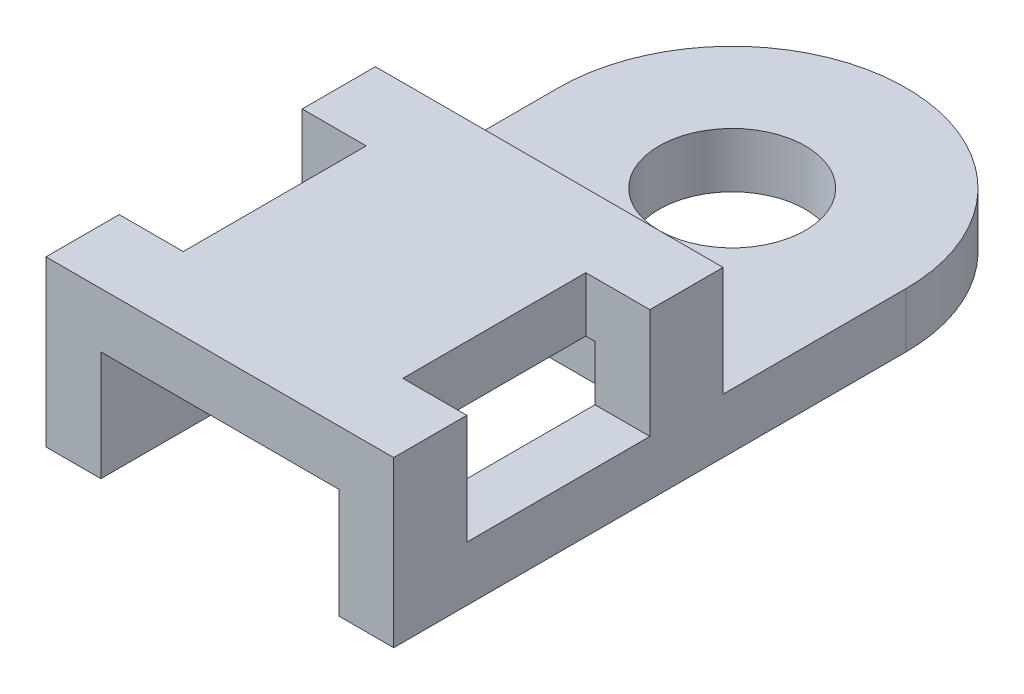
ISO-10303-21;
HEADER;
FILE_DESCRIPTION(('STEP AP214'),'2;1');
FILE_NAME('part.step','',(''),(''),'','','');
FILE_SCHEMA(('AUTOMOTIVE_DESIGN { 1 0 10303 214 1 1 1 1 }'));
ENDSEC;
DATA;
#1=APPLICATION_CONTEXT('core data for automotive mechanical design processes');
#2=APPLICATION_PROTOCOL_DEFINITION('international standard','automotive_design',2000,#1);
#3=PRODUCT_CONTEXT('',#1,'mechanical');
#4=PRODUCT('Part','Part','',(#3));
#5=PRODUCT_RELATED_PRODUCT_CATEGORY('part','',(#4));
#6=PRODUCT_DEFINITION_FORMATION('','',#4);
#7=PRODUCT_DEFINITION_CONTEXT('part definition',#1,'design');
#8=PRODUCT_DEFINITION('design','',#6,#7);
#9=PRODUCT_DEFINITION_SHAPE('','',#8);
#10=(LENGTH_UNIT() NAMED_UNIT(*) SI_UNIT(.MILLI.,.METRE.));
#11=(NAMED_UNIT(*) PLANE_ANGLE_UNIT() SI_UNIT($,.RADIAN.));
#12=(NAMED_UNIT(*) SI_UNIT($,.STERADIAN.) SOLID_ANGLE_UNIT());
#13=UNCERTAINTY_MEASURE_WITH_UNIT(LENGTH_MEASURE(1.E-05),#10,'distance_accuracy_value','');
#14=(GEOMETRIC_REPRESENTATION_CONTEXT(3) GLOBAL_UNCERTAINTY_ASSIGNED_CONTEXT((#13)) GLOBAL_UNIT_ASSIGNED_CONTEXT((#10,
#11,#12)) REPRESENTATION_CONTEXT('',''));
#15=CARTESIAN_POINT('',(0.,0.,0.));
#16=DIRECTION('',(0.,0.,1.));
#17=DIRECTION('',(1.,0.,0.));
#18=AXIS2_PLACEMENT_3D('',#15,#16,#17);
#19=CARTESIAN_POINT('',(0.,1.5,0.));
#20=DIRECTION('',(0.,1.,0.));
#21=DIRECTION('',(0.,0.,1.));
#22=AXIS2_PLACEMENT_3D('',#19,#20,#21);
#23=PLANE('',#22);
#24=DIRECTION('',(-1.,0.,0.));
#25=VECTOR('',#24,1.);
#26=CARTESIAN_POINT('',(4.75,1.5,5.));
#27=LINE('',#26,#25);
#28=CARTESIAN_POINT('',(4.75,1.5,5.));
#29=VERTEX_POINT('',#28);
#30=CARTESIAN_POINT('',(3.25,1.5,5.));
#31=VERTEX_POINT('',#30);
#32=EDGE_CURVE('E307',#29,#31,#27,.T.);
#33=ORIENTED_EDGE('',*,*,#32,.F.);
#34=DIRECTION('',(0.,0.,-1.));
#35=VECTOR('',#34,1.);
#36=CARTESIAN_POINT('',(4.75,1.5,14.));
#37=LINE('',#36,#35);
#38=CARTESIAN_POINT('',(4.75,1.5,0.));
#39=VERTEX_POINT('',#38);
#40=EDGE_CURVE('E330',#29,#39,#37,.T.);
#41=ORIENTED_EDGE('',*,*,#40,.T.);
#42=CARTESIAN_POINT('',(0.,1.5,0.));
#43=DIRECTION('',(0.,1.,0.));
#44=DIRECTION('',(0.,0.,1.));
#45=AXIS2_PLACEMENT_3D('',#42,#43,#44);
#46=CIRCLE('',#45,4.75);
#47=CARTESIAN_POINT('',(-4.75,1.5,0.));
#48=VERTEX_POINT('',#47);
#49=EDGE_CURVE('E323',#39,#48,#46,.T.);
#50=ORIENTED_EDGE('',*,*,#49,.T.);
#51=DIRECTION('',(0.,0.,1.));
#52=VECTOR('',#51,1.);
#53=CARTESIAN_POINT('',(-4.75,1.5,0.));
#54=LINE('',#53,#52);
#55=CARTESIAN_POINT('',(-4.75,1.5,5.));
#56=VERTEX_POINT('',#55);
#57=EDGE_CURVE('E326',#48,#56,#54,.T.);
#58=ORIENTED_EDGE('',*,*,#57,.T.);
#59=CARTESIAN_POINT('',(-3.25,1.5,5.));
#60=VERTEX_POINT('',#59);
#61=EDGE_CURVE('E284',#60,#56,#27,.T.);
#62=ORIENTED_EDGE('',*,*,#61,.F.);
#63=EDGE_CURVE('E310',#31,#60,#27,.T.);
#64=ORIENTED_EDGE('',*,*,#63,.F.);
#65=EDGE_LOOP('',(#33,#41,#50,#58,#62,#64));
#66=FACE_BOUND('',#65,.T.);
#67=CARTESIAN_POINT('',(0.,1.5,0.));
#68=DIRECTION('',(0.,1.,0.));
#69=DIRECTION('',(0.,0.,1.));
#70=AXIS2_PLACEMENT_3D('',#67,#68,#69);
#71=CIRCLE('',#70,2.);
#72=CARTESIAN_POINT('',(0.,1.5,2.));
#73=VERTEX_POINT('',#72);
#74=EDGE_CURVE('E317',#73,#73,#71,.T.);
#75=ORIENTED_EDGE('',*,*,#74,.F.);
#76=EDGE_LOOP('',(#75));
#77=FACE_BOUND('',#76,.T.);
#78=ADVANCED_FACE('F35',(#66,#77),#23,.T.);
#79=CARTESIAN_POINT('',(0.,0.,0.));
#80=DIRECTION('',(0.,1.,0.));
#81=DIRECTION('',(0.,0.,1.));
#82=AXIS2_PLACEMENT_3D('',#79,#80,#81);
#83=PLANE('',#82);
#84=DIRECTION('',(1.,0.,0.));
#85=VECTOR('',#84,1.);
#86=CARTESIAN_POINT('',(-4.75,0.,14.));
#87=LINE('',#86,#85);
#88=CARTESIAN_POINT('',(3.25,0.,14.));
#89=VERTEX_POINT('',#88);
#90=CARTESIAN_POINT('',(4.75,0.,14.));
#91=VERTEX_POINT('',#90);
#92=EDGE_CURVE('E337',#89,#91,#87,.T.);
#93=ORIENTED_EDGE('',*,*,#92,.F.);
#94=DIRECTION('',(0.,0.,1.));
#95=VECTOR('',#94,1.);
#96=CARTESIAN_POINT('',(3.25,0.,14.));
#97=LINE('',#96,#95);
#98=CARTESIAN_POINT('',(3.25,0.,5.));
#99=VERTEX_POINT('',#98);
#100=EDGE_CURVE('E264',#99,#89,#97,.T.);
#101=ORIENTED_EDGE('',*,*,#100,.F.);
#102=DIRECTION('',(1.,0.,0.));
#103=VECTOR('',#102,1.);
#104=CARTESIAN_POINT('',(3.25,0.,5.));
#105=LINE('',#104,#103);
#106=CARTESIAN_POINT('',(-3.25,0.,5.));
#107=VERTEX_POINT('',#106);
#108=EDGE_CURVE('E277',#107,#99,#105,.T.);
#109=ORIENTED_EDGE('',*,*,#108,.F.);
#110=DIRECTION('',(0.,0.,-1.));
#111=VECTOR('',#110,1.);
#112=CARTESIAN_POINT('',(-3.25,0.,5.));
#113=LINE('',#112,#111);
#114=CARTESIAN_POINT('',(-3.25,0.,14.));
#115=VERTEX_POINT('',#114);
#116=EDGE_CURVE('E259',#115,#107,#113,.T.);
#117=ORIENTED_EDGE('',*,*,#116,.F.);
#118=CARTESIAN_POINT('',(-4.75,0.,14.));
#119=VERTEX_POINT('',#118);
#120=EDGE_CURVE('E338',#119,#115,#87,.T.);
#121=ORIENTED_EDGE('',*,*,#120,.F.);
#122=DIRECTION('',(0.,0.,1.));
#123=VECTOR('',#122,1.);
#124=CARTESIAN_POINT('',(-4.75,0.,0.));
#125=LINE('',#124,#123);
#126=CARTESIAN_POINT('',(-4.75,0.,0.));
#127=VERTEX_POINT('',#126);
#128=EDGE_CURVE('E335',#127,#119,#125,.T.);
#129=ORIENTED_EDGE('',*,*,#128,.F.);
#130=CARTESIAN_POINT('',(0.,0.,0.));
#131=DIRECTION('',(0.,1.,0.));
#132=DIRECTION('',(0.,0.,1.));
#133=AXIS2_PLACEMENT_3D('',#130,#131,#132);
#134=CIRCLE('',#133,4.75);
#135=CARTESIAN_POINT('',(4.75,0.,0.));
#136=VERTEX_POINT('',#135);
#137=EDGE_CURVE('E320',#136,#127,#134,.T.);
#138=ORIENTED_EDGE('',*,*,#137,.F.);
#139=DIRECTION('',(0.,0.,-1.));
#140=VECTOR('',#139,1.);
#141=CARTESIAN_POINT('',(4.75,0.,14.));
#142=LINE('',#141,#140);
#143=EDGE_CURVE('E327',#91,#136,#142,.T.);
#144=ORIENTED_EDGE('',*,*,#143,.F.);
#145=EDGE_LOOP('',(#93,#101,#109,#117,#121,#129,#138,#144));
#146=FACE_BOUND('',#145,.T.);
#147=CARTESIAN_POINT('',(0.,0.,0.));
#148=DIRECTION('',(0.,1.,0.));
#149=DIRECTION('',(0.,0.,1.));
#150=AXIS2_PLACEMENT_3D('',#147,#148,#149);
#151=CIRCLE('',#150,2.);
#152=CARTESIAN_POINT('',(0.,0.,2.));
#153=VERTEX_POINT('',#152);
#154=EDGE_CURVE('E316',#153,#153,#151,.T.);
#155=ORIENTED_EDGE('',*,*,#154,.T.);
#156=EDGE_LOOP('',(#155));
#157=FACE_BOUND('',#156,.T.);
#158=ADVANCED_FACE('F430',(#146,#157),#83,.F.);
#159=CARTESIAN_POINT('',(0.,1.5,0.));
#160=DIRECTION('',(0.,-1.,0.));
#161=DIRECTION('',(0.,0.,-1.));
#162=AXIS2_PLACEMENT_3D('',#159,#160,#161);
#163=CYLINDRICAL_SURFACE('',#162,4.75);
#164=ORIENTED_EDGE('',*,*,#137,.T.);
#165=DIRECTION('',(0.,-1.,0.));
#166=VECTOR('',#165,1.);
#167=CARTESIAN_POINT('',(-4.75,1.5,0.));
#168=LINE('',#167,#166);
#169=EDGE_CURVE('E350',#48,#127,#168,.T.);
#170=ORIENTED_EDGE('',*,*,#169,.F.);
#171=ORIENTED_EDGE('',*,*,#49,.F.);
#172=DIRECTION('',(0.,-1.,0.));
#173=VECTOR('',#172,1.);
#174=CARTESIAN_POINT('',(4.75,1.5,0.));
#175=LINE('',#174,#173);
#176=EDGE_CURVE('E332',#39,#136,#175,.T.);
#177=ORIENTED_EDGE('',*,*,#176,.T.);
#178=EDGE_LOOP('',(#164,#170,#171,#177));
#179=FACE_BOUND('',#178,.T.);
#180=ADVANCED_FACE('F37',(#179),#163,.T.);
#181=CARTESIAN_POINT('',(-4.75,1.5,0.));
#182=DIRECTION('',(1.,0.,0.));
#183=DIRECTION('',(0.,0.,-1.));
#184=AXIS2_PLACEMENT_3D('',#181,#182,#183);
#185=PLANE('',#184);
#186=DIRECTION('',(0.,0.,1.));
#187=VECTOR('',#186,1.);
#188=CARTESIAN_POINT('',(-4.75,1.5,12.));
#189=LINE('',#188,#187);
#190=CARTESIAN_POINT('',(-4.75,1.5,7.));
#191=VERTEX_POINT('',#190);
#192=CARTESIAN_POINT('',(-4.75,1.5,12.));
#193=VERTEX_POINT('',#192);
#194=EDGE_CURVE('E229',#191,#193,#189,.T.);
#195=ORIENTED_EDGE('',*,*,#194,.F.);
#196=DIRECTION('',(0.,1.,0.));
#197=VECTOR('',#196,1.);
#198=CARTESIAN_POINT('',(-4.75,1.5,7.));
#199=LINE('',#198,#197);
#200=CARTESIAN_POINT('',(-4.75,4.5,7.));
#201=VERTEX_POINT('',#200);
#202=EDGE_CURVE('E245',#191,#201,#199,.T.);
#203=ORIENTED_EDGE('',*,*,#202,.T.);
#204=DIRECTION('',(0.,0.,1.));
#205=VECTOR('',#204,1.);
#206=CARTESIAN_POINT('',(-4.75,4.5,5.));
#207=LINE('',#206,#205);
#208=CARTESIAN_POINT('',(-4.75,4.5,5.));
#209=VERTEX_POINT('',#208);
#210=EDGE_CURVE('E294',#209,#201,#207,.T.);
#211=ORIENTED_EDGE('',*,*,#210,.F.);
#212=DIRECTION('',(0.,-1.,0.));
#213=VECTOR('',#212,1.);
#214=CARTESIAN_POINT('',(-4.75,4.5,5.));
#215=LINE('',#214,#213);
#216=EDGE_CURVE('E306',#209,#56,#215,.T.);
#217=ORIENTED_EDGE('',*,*,#216,.T.);
#218=ORIENTED_EDGE('',*,*,#57,.F.);
#219=ORIENTED_EDGE('',*,*,#169,.T.);
#220=ORIENTED_EDGE('',*,*,#128,.T.);
#221=DIRECTION('',(0.,-1.,0.));
#222=VECTOR('',#221,1.);
#223=CARTESIAN_POINT('',(-4.75,1.5,14.));
#224=LINE('',#223,#222);
#225=CARTESIAN_POINT('',(-4.75,4.5,14.));
#226=VERTEX_POINT('',#225);
#227=EDGE_CURVE('E347',#226,#119,#224,.T.);
#228=ORIENTED_EDGE('',*,*,#227,.F.);
#229=CARTESIAN_POINT('',(-4.75,4.5,12.));
#230=VERTEX_POINT('',#229);
#231=EDGE_CURVE('E298',#230,#226,#207,.T.);
#232=ORIENTED_EDGE('',*,*,#231,.F.);
#233=DIRECTION('',(0.,1.,0.));
#234=VECTOR('',#233,1.);
#235=CARTESIAN_POINT('',(-4.75,1.5,12.));
#236=LINE('',#235,#234);
#237=EDGE_CURVE('E238',#193,#230,#236,.T.);
#238=ORIENTED_EDGE('',*,*,#237,.F.);
#239=EDGE_LOOP('',(#195,#203,#211,#217,#218,#219,#220,#228,#232,#238));
#240=FACE_BOUND('',#239,.T.);
#241=ADVANCED_FACE('F398',(#240),#185,.F.);
#242=CARTESIAN_POINT('',(-4.75,1.5,14.));
#243=DIRECTION('',(0.,0.,-1.));
#244=DIRECTION('',(-1.,0.,0.));
#245=AXIS2_PLACEMENT_3D('',#242,#243,#244);
#246=PLANE('',#245);
#247=DIRECTION('',(-1.,0.,0.));
#248=VECTOR('',#247,1.);
#249=CARTESIAN_POINT('',(-3.25,3.,14.));
#250=LINE('',#249,#248);
#251=CARTESIAN_POINT('',(3.25,3.,14.));
#252=VERTEX_POINT('',#251);
#253=CARTESIAN_POINT('',(-3.25,3.,14.));
#254=VERTEX_POINT('',#253);
#255=EDGE_CURVE('E260',#252,#254,#250,.T.);
#256=ORIENTED_EDGE('',*,*,#255,.F.);
#257=DIRECTION('',(0.,-1.,0.));
#258=VECTOR('',#257,1.);
#259=CARTESIAN_POINT('',(3.25,3.,14.));
#260=LINE('',#259,#258);
#261=EDGE_CURVE('E281',#252,#89,#260,.T.);
#262=ORIENTED_EDGE('',*,*,#261,.T.);
#263=ORIENTED_EDGE('',*,*,#92,.T.);
#264=DIRECTION('',(0.,-1.,0.));
#265=VECTOR('',#264,1.);
#266=CARTESIAN_POINT('',(4.75,1.5,14.));
#267=LINE('',#266,#265);
#268=CARTESIAN_POINT('',(4.75,4.5,14.));
#269=VERTEX_POINT('',#268);
#270=EDGE_CURVE('E344',#269,#91,#267,.T.);
#271=ORIENTED_EDGE('',*,*,#270,.F.);
#272=DIRECTION('',(1.,0.,0.));
#273=VECTOR('',#272,1.);
#274=CARTESIAN_POINT('',(-4.75,4.5,14.));
#275=LINE('',#274,#273);
#276=EDGE_CURVE('E297',#226,#269,#275,.T.);
#277=ORIENTED_EDGE('',*,*,#276,.F.);
#278=ORIENTED_EDGE('',*,*,#227,.T.);
#279=ORIENTED_EDGE('',*,*,#120,.T.);
#280=DIRECTION('',(0.,-1.,0.));
#281=VECTOR('',#280,1.);
#282=CARTESIAN_POINT('',(-3.25,3.,14.));
#283=LINE('',#282,#281);
#284=EDGE_CURVE('E274',#254,#115,#283,.T.);
#285=ORIENTED_EDGE('',*,*,#284,.F.);
#286=EDGE_LOOP('',(#256,#262,#263,#271,#277,#278,#279,#285));
#287=FACE_BOUND('',#286,.T.);
#288=ADVANCED_FACE('F383',(#287),#246,.F.);
#289=CARTESIAN_POINT('',(4.75,1.5,14.));
#290=DIRECTION('',(-1.,0.,0.));
#291=DIRECTION('',(0.,0.,1.));
#292=AXIS2_PLACEMENT_3D('',#289,#290,#291);
#293=PLANE('',#292);
#294=DIRECTION('',(0.,0.,-1.));
#295=VECTOR('',#294,1.);
#296=CARTESIAN_POINT('',(4.75,1.5,12.));
#297=LINE('',#296,#295);
#298=CARTESIAN_POINT('',(4.75,1.5,12.));
#299=VERTEX_POINT('',#298);
#300=CARTESIAN_POINT('',(4.75,1.5,7.));
#301=VERTEX_POINT('',#300);
#302=EDGE_CURVE('E193',#299,#301,#297,.T.);
#303=ORIENTED_EDGE('',*,*,#302,.F.);
#304=DIRECTION('',(0.,1.,0.));
#305=VECTOR('',#304,1.);
#306=CARTESIAN_POINT('',(4.75,1.5,12.));
#307=LINE('',#306,#305);
#308=CARTESIAN_POINT('',(4.75,4.5,12.));
#309=VERTEX_POINT('',#308);
#310=EDGE_CURVE('E200',#299,#309,#307,.T.);
#311=ORIENTED_EDGE('',*,*,#310,.T.);
#312=DIRECTION('',(0.,0.,-1.));
#313=VECTOR('',#312,1.);
#314=CARTESIAN_POINT('',(4.75,4.5,14.));
#315=LINE('',#314,#313);
#316=EDGE_CURVE('E302',#269,#309,#315,.T.);
#317=ORIENTED_EDGE('',*,*,#316,.F.);
#318=ORIENTED_EDGE('',*,*,#270,.T.);
#319=ORIENTED_EDGE('',*,*,#143,.T.);
#320=ORIENTED_EDGE('',*,*,#176,.F.);
#321=ORIENTED_EDGE('',*,*,#40,.F.);
#322=DIRECTION('',(0.,-1.,0.));
#323=VECTOR('',#322,1.);
#324=CARTESIAN_POINT('',(4.75,4.5,5.));
#325=LINE('',#324,#323);
#326=CARTESIAN_POINT('',(4.75,4.5,5.));
#327=VERTEX_POINT('',#326);
#328=EDGE_CURVE('E313',#327,#29,#325,.T.);
#329=ORIENTED_EDGE('',*,*,#328,.F.);
#330=CARTESIAN_POINT('',(4.75,4.5,7.));
#331=VERTEX_POINT('',#330);
#332=EDGE_CURVE('E301',#331,#327,#315,.T.);
#333=ORIENTED_EDGE('',*,*,#332,.F.);
#334=DIRECTION('',(0.,1.,0.));
#335=VECTOR('',#334,1.);
#336=CARTESIAN_POINT('',(4.75,1.5,7.));
#337=LINE('',#336,#335);
#338=EDGE_CURVE('E50',#301,#331,#337,.T.);
#339=ORIENTED_EDGE('',*,*,#338,.F.);
#340=EDGE_LOOP('',(#303,#311,#317,#318,#319,#320,#321,#329,#333,#339));
#341=FACE_BOUND('',#340,.T.);
#342=ADVANCED_FACE('F209',(#341),#293,.F.);
#343=CARTESIAN_POINT('',(0.,1.5,0.));
#344=DIRECTION('',(0.,-1.,0.));
#345=DIRECTION('',(0.,0.,-1.));
#346=AXIS2_PLACEMENT_3D('',#343,#344,#345);
#347=CYLINDRICAL_SURFACE('',#346,2.);
#348=ORIENTED_EDGE('',*,*,#74,.T.);
#349=EDGE_LOOP('',(#348));
#350=FACE_BOUND('',#349,.T.);
#351=ORIENTED_EDGE('',*,*,#154,.F.);
#352=EDGE_LOOP('',(#351));
#353=FACE_BOUND('',#352,.T.);
#354=ADVANCED_FACE('F440',(#350,#353),#347,.F.);
#355=CARTESIAN_POINT('',(4.75,4.5,5.));
#356=DIRECTION('',(0.,0.,1.));
#357=DIRECTION('',(1.,0.,0.));
#358=AXIS2_PLACEMENT_3D('',#355,#356,#357);
#359=PLANE('',#358);
#360=ORIENTED_EDGE('',*,*,#32,.T.);
#361=DIRECTION('',(0.,-1.,0.));
#362=VECTOR('',#361,1.);
#363=CARTESIAN_POINT('',(3.25,3.,5.));
#364=LINE('',#363,#362);
#365=CARTESIAN_POINT('',(3.25,3.,5.));
#366=VERTEX_POINT('',#365);
#367=EDGE_CURVE('E285',#366,#31,#364,.T.);
#368=ORIENTED_EDGE('',*,*,#367,.F.);
#369=DIRECTION('',(1.,0.,0.));
#370=VECTOR('',#369,1.);
#371=CARTESIAN_POINT('',(3.25,3.,5.));
#372=LINE('',#371,#370);
#373=CARTESIAN_POINT('',(-3.25,3.,5.));
#374=VERTEX_POINT('',#373);
#375=EDGE_CURVE('E268',#374,#366,#372,.T.);
#376=ORIENTED_EDGE('',*,*,#375,.F.);
#377=DIRECTION('',(0.,-1.,0.));
#378=VECTOR('',#377,1.);
#379=CARTESIAN_POINT('',(-3.25,3.,5.));
#380=LINE('',#379,#378);
#381=EDGE_CURVE('E289',#374,#60,#380,.T.);
#382=ORIENTED_EDGE('',*,*,#381,.T.);
#383=ORIENTED_EDGE('',*,*,#61,.T.);
#384=ORIENTED_EDGE('',*,*,#216,.F.);
#385=DIRECTION('',(-1.,0.,0.));
#386=VECTOR('',#385,1.);
#387=CARTESIAN_POINT('',(4.75,4.5,5.));
#388=LINE('',#387,#386);
#389=EDGE_CURVE('E304',#327,#209,#388,.T.);
#390=ORIENTED_EDGE('',*,*,#389,.F.);
#391=ORIENTED_EDGE('',*,*,#328,.T.);
#392=EDGE_LOOP('',(#360,#368,#376,#382,#383,#384,#390,#391));
#393=FACE_BOUND('',#392,.T.);
#394=ADVANCED_FACE('F416',(#393),#359,.F.);
#395=CARTESIAN_POINT('',(0.,4.5,0.));
#396=DIRECTION('',(0.,1.,0.));
#397=DIRECTION('',(0.,0.,1.));
#398=AXIS2_PLACEMENT_3D('',#395,#396,#397);
#399=PLANE('',#398);
#400=DIRECTION('',(1.,0.,0.));
#401=VECTOR('',#400,1.);
#402=CARTESIAN_POINT('',(3.,4.5,12.));
#403=LINE('',#402,#401);
#404=CARTESIAN_POINT('',(3.,4.5,12.));
#405=VERTEX_POINT('',#404);
#406=EDGE_CURVE('E203',#405,#309,#403,.T.);
#407=ORIENTED_EDGE('',*,*,#406,.F.);
#408=DIRECTION('',(0.,0.,1.));
#409=VECTOR('',#408,1.);
#410=CARTESIAN_POINT('',(3.,4.5,7.));
#411=LINE('',#410,#409);
#412=CARTESIAN_POINT('',(3.,4.5,7.));
#413=VERTEX_POINT('',#412);
#414=EDGE_CURVE('E197',#413,#405,#411,.T.);
#415=ORIENTED_EDGE('',*,*,#414,.F.);
#416=DIRECTION('',(-1.,0.,0.));
#417=VECTOR('',#416,1.);
#418=CARTESIAN_POINT('',(4.75,4.5,7.));
#419=LINE('',#418,#417);
#420=EDGE_CURVE('E215',#331,#413,#419,.T.);
#421=ORIENTED_EDGE('',*,*,#420,.F.);
#422=ORIENTED_EDGE('',*,*,#332,.T.);
#423=ORIENTED_EDGE('',*,*,#389,.T.);
#424=ORIENTED_EDGE('',*,*,#210,.T.);
#425=DIRECTION('',(-1.,0.,0.));
#426=VECTOR('',#425,1.);
#427=CARTESIAN_POINT('',(-4.75,4.5,7.));
#428=LINE('',#427,#426);
#429=CARTESIAN_POINT('',(-3.,4.5,7.));
#430=VERTEX_POINT('',#429);
#431=EDGE_CURVE('E233',#430,#201,#428,.T.);
#432=ORIENTED_EDGE('',*,*,#431,.F.);
#433=DIRECTION('',(0.,0.,-1.));
#434=VECTOR('',#433,1.);
#435=CARTESIAN_POINT('',(-3.,4.5,7.));
#436=LINE('',#435,#434);
#437=CARTESIAN_POINT('',(-3.,4.5,12.));
#438=VERTEX_POINT('',#437);
#439=EDGE_CURVE('E241',#438,#430,#436,.T.);
#440=ORIENTED_EDGE('',*,*,#439,.F.);
#441=DIRECTION('',(1.,0.,0.));
#442=VECTOR('',#441,1.);
#443=CARTESIAN_POINT('',(-3.,4.5,12.));
#444=LINE('',#443,#442);
#445=EDGE_CURVE('E228',#230,#438,#444,.T.);
#446=ORIENTED_EDGE('',*,*,#445,.F.);
#447=ORIENTED_EDGE('',*,*,#231,.T.);
#448=ORIENTED_EDGE('',*,*,#276,.T.);
#449=ORIENTED_EDGE('',*,*,#316,.T.);
#450=EDGE_LOOP('',(#407,#415,#421,#422,#423,#424,#432,#440,#446,#447,#448,#449));
#451=FACE_BOUND('',#450,.T.);
#452=ADVANCED_FACE('F403',(#451),#399,.T.);
#453=CARTESIAN_POINT('',(3.25,3.,14.));
#454=DIRECTION('',(1.,0.,0.));
#455=DIRECTION('',(0.,0.,-1.));
#456=AXIS2_PLACEMENT_3D('',#453,#454,#455);
#457=PLANE('',#456);
#458=DIRECTION('',(0.,0.,1.));
#459=VECTOR('',#458,1.);
#460=CARTESIAN_POINT('',(3.25,3.,14.));
#461=LINE('',#460,#459);
#462=CARTESIAN_POINT('',(3.25,3.,12.));
#463=VERTEX_POINT('',#462);
#464=EDGE_CURVE('E270',#463,#252,#461,.T.);
#465=ORIENTED_EDGE('',*,*,#464,.F.);
#466=DIRECTION('',(0.,-1.,0.));
#467=VECTOR('',#466,1.);
#468=CARTESIAN_POINT('',(3.25,3.,12.));
#469=LINE('',#468,#467);
#470=CARTESIAN_POINT('',(3.25,1.5,12.));
#471=VERTEX_POINT('',#470);
#472=EDGE_CURVE('E226',#463,#471,#469,.T.);
#473=ORIENTED_EDGE('',*,*,#472,.T.);
#474=DIRECTION('',(0.,0.,1.));
#475=VECTOR('',#474,1.);
#476=CARTESIAN_POINT('',(3.25,1.5,14.));
#477=LINE('',#476,#475);
#478=CARTESIAN_POINT('',(3.25,1.5,7.));
#479=VERTEX_POINT('',#478);
#480=EDGE_CURVE('E11',#479,#471,#477,.T.);
#481=ORIENTED_EDGE('',*,*,#480,.F.);
#482=DIRECTION('',(0.,1.,0.));
#483=VECTOR('',#482,1.);
#484=CARTESIAN_POINT('',(3.25,3.,7.));
#485=LINE('',#484,#483);
#486=CARTESIAN_POINT('',(3.25,3.,7.));
#487=VERTEX_POINT('',#486);
#488=EDGE_CURVE('E221',#479,#487,#485,.T.);
#489=ORIENTED_EDGE('',*,*,#488,.T.);
#490=EDGE_CURVE('E271',#366,#487,#461,.T.);
#491=ORIENTED_EDGE('',*,*,#490,.F.);
#492=ORIENTED_EDGE('',*,*,#367,.T.);
#493=EDGE_CURVE('E288',#31,#99,#364,.T.);
#494=ORIENTED_EDGE('',*,*,#493,.T.);
#495=ORIENTED_EDGE('',*,*,#100,.T.);
#496=ORIENTED_EDGE('',*,*,#261,.F.);
#497=EDGE_LOOP('',(#465,#473,#481,#489,#491,#492,#494,#495,#496));
#498=FACE_BOUND('',#497,.T.);
#499=ADVANCED_FACE('F377',(#498),#457,.F.);
#500=CARTESIAN_POINT('',(3.25,3.,5.));
#501=DIRECTION('',(0.,0.,-1.));
#502=DIRECTION('',(-1.,0.,0.));
#503=AXIS2_PLACEMENT_3D('',#500,#501,#502);
#504=PLANE('',#503);
#505=ORIENTED_EDGE('',*,*,#63,.T.);
#506=EDGE_CURVE('E292',#60,#107,#380,.T.);
#507=ORIENTED_EDGE('',*,*,#506,.T.);
#508=ORIENTED_EDGE('',*,*,#108,.T.);
#509=ORIENTED_EDGE('',*,*,#493,.F.);
#510=EDGE_LOOP('',(#505,#507,#508,#509));
#511=FACE_BOUND('',#510,.T.);
#512=ADVANCED_FACE('F483',(#511),#504,.F.);
#513=CARTESIAN_POINT('',(-3.25,3.,5.));
#514=DIRECTION('',(-1.,0.,0.));
#515=DIRECTION('',(0.,0.,1.));
#516=AXIS2_PLACEMENT_3D('',#513,#514,#515);
#517=PLANE('',#516);
#518=DIRECTION('',(0.,0.,-1.));
#519=VECTOR('',#518,1.);
#520=CARTESIAN_POINT('',(-3.25,3.,5.));
#521=LINE('',#520,#519);
#522=CARTESIAN_POINT('',(-3.25,3.,7.));
#523=VERTEX_POINT('',#522);
#524=EDGE_CURVE('E263',#523,#374,#521,.T.);
#525=ORIENTED_EDGE('',*,*,#524,.F.);
#526=DIRECTION('',(0.,-1.,0.));
#527=VECTOR('',#526,1.);
#528=CARTESIAN_POINT('',(-3.25,3.,7.));
#529=LINE('',#528,#527);
#530=CARTESIAN_POINT('',(-3.25,1.5,7.));
#531=VERTEX_POINT('',#530);
#532=EDGE_CURVE('E256',#523,#531,#529,.T.);
#533=ORIENTED_EDGE('',*,*,#532,.T.);
#534=DIRECTION('',(0.,0.,1.));
#535=VECTOR('',#534,1.);
#536=CARTESIAN_POINT('',(-3.25,1.5,5.));
#537=LINE('',#536,#535);
#538=CARTESIAN_POINT('',(-3.25,1.5,12.));
#539=VERTEX_POINT('',#538);
#540=EDGE_CURVE('E362',#531,#539,#537,.T.);
#541=ORIENTED_EDGE('',*,*,#540,.T.);
#542=DIRECTION('',(0.,1.,0.));
#543=VECTOR('',#542,1.);
#544=CARTESIAN_POINT('',(-3.25,3.,12.));
#545=LINE('',#544,#543);
#546=CARTESIAN_POINT('',(-3.25,3.,12.));
#547=VERTEX_POINT('',#546);
#548=EDGE_CURVE('E248',#539,#547,#545,.T.);
#549=ORIENTED_EDGE('',*,*,#548,.T.);
#550=EDGE_CURVE('E265',#254,#547,#521,.T.);
#551=ORIENTED_EDGE('',*,*,#550,.F.);
#552=ORIENTED_EDGE('',*,*,#284,.T.);
#553=ORIENTED_EDGE('',*,*,#116,.T.);
#554=ORIENTED_EDGE('',*,*,#506,.F.);
#555=ORIENTED_EDGE('',*,*,#381,.F.);
#556=EDGE_LOOP('',(#525,#533,#541,#549,#551,#552,#553,#554,#555));
#557=FACE_BOUND('',#556,.T.);
#558=ADVANCED_FACE('F386',(#557),#517,.F.);
#559=CARTESIAN_POINT('',(0.,3.,0.));
#560=DIRECTION('',(0.,1.,0.));
#561=DIRECTION('',(0.,0.,1.));
#562=AXIS2_PLACEMENT_3D('',#559,#560,#561);
#563=PLANE('',#562);
#564=DIRECTION('',(0.,0.,1.));
#565=VECTOR('',#564,1.);
#566=CARTESIAN_POINT('',(3.,3.,0.));
#567=LINE('',#566,#565);
#568=CARTESIAN_POINT('',(3.,3.,7.));
#569=VERTEX_POINT('',#568);
#570=CARTESIAN_POINT('',(3.,3.,12.));
#571=VERTEX_POINT('',#570);
#572=EDGE_CURVE('E368',#569,#571,#567,.T.);
#573=ORIENTED_EDGE('',*,*,#572,.T.);
#574=DIRECTION('',(1.,0.,0.));
#575=VECTOR('',#574,1.);
#576=CARTESIAN_POINT('',(0.,3.,12.));
#577=LINE('',#576,#575);
#578=EDGE_CURVE('E43',#571,#463,#577,.T.);
#579=ORIENTED_EDGE('',*,*,#578,.T.);
#580=ORIENTED_EDGE('',*,*,#464,.T.);
#581=ORIENTED_EDGE('',*,*,#255,.T.);
#582=ORIENTED_EDGE('',*,*,#550,.T.);
#583=DIRECTION('',(1.,0.,0.));
#584=VECTOR('',#583,1.);
#585=CARTESIAN_POINT('',(0.,3.,12.));
#586=LINE('',#585,#584);
#587=CARTESIAN_POINT('',(-3.,3.,12.));
#588=VERTEX_POINT('',#587);
#589=EDGE_CURVE('E353',#547,#588,#586,.T.);
#590=ORIENTED_EDGE('',*,*,#589,.T.);
#591=DIRECTION('',(0.,0.,-1.));
#592=VECTOR('',#591,1.);
#593=CARTESIAN_POINT('',(-3.,3.,0.));
#594=LINE('',#593,#592);
#595=CARTESIAN_POINT('',(-3.,3.,7.));
#596=VERTEX_POINT('',#595);
#597=EDGE_CURVE('E356',#588,#596,#594,.T.);
#598=ORIENTED_EDGE('',*,*,#597,.T.);
#599=DIRECTION('',(-1.,0.,0.));
#600=VECTOR('',#599,1.);
#601=CARTESIAN_POINT('',(0.,3.,7.));
#602=LINE('',#601,#600);
#603=EDGE_CURVE('E359',#596,#523,#602,.T.);
#604=ORIENTED_EDGE('',*,*,#603,.T.);
#605=ORIENTED_EDGE('',*,*,#524,.T.);
#606=ORIENTED_EDGE('',*,*,#375,.T.);
#607=ORIENTED_EDGE('',*,*,#490,.T.);
#608=DIRECTION('',(-1.,0.,0.));
#609=VECTOR('',#608,1.);
#610=CARTESIAN_POINT('',(0.,3.,7.));
#611=LINE('',#610,#609);
#612=EDGE_CURVE('E365',#487,#569,#611,.T.);
#613=ORIENTED_EDGE('',*,*,#612,.T.);
#614=EDGE_LOOP('',(#573,#579,#580,#581,#582,#590,#598,#604,#605,#606,#607,#613));
#615=FACE_BOUND('',#614,.T.);
#616=ADVANCED_FACE('F373',(#615),#563,.F.);
#617=CARTESIAN_POINT('',(0.,1.5,0.));
#618=DIRECTION('',(0.,-1.,0.));
#619=DIRECTION('',(0.,0.,-1.));
#620=AXIS2_PLACEMENT_3D('',#617,#618,#619);
#621=PLANE('',#620);
#622=DIRECTION('',(-1.,0.,0.));
#623=VECTOR('',#622,1.);
#624=CARTESIAN_POINT('',(-4.75,1.5,7.));
#625=LINE('',#624,#623);
#626=EDGE_CURVE('E236',#531,#191,#625,.T.);
#627=ORIENTED_EDGE('',*,*,#626,.T.);
#628=ORIENTED_EDGE('',*,*,#194,.T.);
#629=DIRECTION('',(1.,0.,0.));
#630=VECTOR('',#629,1.);
#631=CARTESIAN_POINT('',(-3.,1.5,12.));
#632=LINE('',#631,#630);
#633=EDGE_CURVE('E232',#193,#539,#632,.T.);
#634=ORIENTED_EDGE('',*,*,#633,.T.);
#635=ORIENTED_EDGE('',*,*,#540,.F.);
#636=EDGE_LOOP('',(#627,#628,#634,#635));
#637=FACE_BOUND('',#636,.T.);
#638=ADVANCED_FACE('F391',(#637),#621,.F.);
#639=CARTESIAN_POINT('',(-4.75,1.5,7.));
#640=DIRECTION('',(0.,0.,-1.));
#641=DIRECTION('',(-1.,0.,0.));
#642=AXIS2_PLACEMENT_3D('',#639,#640,#641);
#643=PLANE('',#642);
#644=ORIENTED_EDGE('',*,*,#603,.F.);
#645=DIRECTION('',(0.,1.,0.));
#646=VECTOR('',#645,1.);
#647=CARTESIAN_POINT('',(-3.,1.5,7.));
#648=LINE('',#647,#646);
#649=EDGE_CURVE('E249',#596,#430,#648,.T.);
#650=ORIENTED_EDGE('',*,*,#649,.T.);
#651=ORIENTED_EDGE('',*,*,#431,.T.);
#652=ORIENTED_EDGE('',*,*,#202,.F.);
#653=ORIENTED_EDGE('',*,*,#626,.F.);
#654=ORIENTED_EDGE('',*,*,#532,.F.);
#655=EDGE_LOOP('',(#644,#650,#651,#652,#653,#654));
#656=FACE_BOUND('',#655,.T.);
#657=ADVANCED_FACE('F467',(#656),#643,.F.);
#658=CARTESIAN_POINT('',(-3.,1.5,7.));
#659=DIRECTION('',(1.,0.,0.));
#660=DIRECTION('',(0.,0.,-1.));
#661=AXIS2_PLACEMENT_3D('',#658,#659,#660);
#662=PLANE('',#661);
#663=DIRECTION('',(0.,1.,0.));
#664=VECTOR('',#663,1.);
#665=CARTESIAN_POINT('',(-3.,1.5,12.));
#666=LINE('',#665,#664);
#667=EDGE_CURVE('E251',#588,#438,#666,.T.);
#668=ORIENTED_EDGE('',*,*,#667,.T.);
#669=ORIENTED_EDGE('',*,*,#439,.T.);
#670=ORIENTED_EDGE('',*,*,#649,.F.);
#671=ORIENTED_EDGE('',*,*,#597,.F.);
#672=EDGE_LOOP('',(#668,#669,#670,#671));
#673=FACE_BOUND('',#672,.T.);
#674=ADVANCED_FACE('F407',(#673),#662,.F.);
#675=CARTESIAN_POINT('',(-3.,1.5,12.));
#676=DIRECTION('',(0.,0.,1.));
#677=DIRECTION('',(1.,0.,0.));
#678=AXIS2_PLACEMENT_3D('',#675,#676,#677);
#679=PLANE('',#678);
#680=ORIENTED_EDGE('',*,*,#633,.F.);
#681=ORIENTED_EDGE('',*,*,#237,.T.);
#682=ORIENTED_EDGE('',*,*,#445,.T.);
#683=ORIENTED_EDGE('',*,*,#667,.F.);
#684=ORIENTED_EDGE('',*,*,#589,.F.);
#685=ORIENTED_EDGE('',*,*,#548,.F.);
#686=EDGE_LOOP('',(#680,#681,#682,#683,#684,#685));
#687=FACE_BOUND('',#686,.T.);
#688=ADVANCED_FACE('F389',(#687),#679,.F.);
#689=CARTESIAN_POINT('',(0.,1.5,0.));
#690=DIRECTION('',(0.,1.,0.));
#691=DIRECTION('',(0.,0.,1.));
#692=AXIS2_PLACEMENT_3D('',#689,#690,#691);
#693=PLANE('',#692);
#694=ORIENTED_EDGE('',*,*,#480,.T.);
#695=DIRECTION('',(1.,0.,0.));
#696=VECTOR('',#695,1.);
#697=CARTESIAN_POINT('',(3.,1.5,12.));
#698=LINE('',#697,#696);
#699=EDGE_CURVE('E188',#471,#299,#698,.T.);
#700=ORIENTED_EDGE('',*,*,#699,.T.);
#701=ORIENTED_EDGE('',*,*,#302,.T.);
#702=DIRECTION('',(-1.,0.,0.));
#703=VECTOR('',#702,1.);
#704=CARTESIAN_POINT('',(4.75,1.5,7.));
#705=LINE('',#704,#703);
#706=EDGE_CURVE('E207',#301,#479,#705,.T.);
#707=ORIENTED_EDGE('',*,*,#706,.T.);
#708=EDGE_LOOP('',(#694,#700,#701,#707));
#709=FACE_BOUND('',#708,.T.);
#710=ADVANCED_FACE('F190',(#709),#693,.T.);
#711=CARTESIAN_POINT('',(3.,1.5,12.));
#712=DIRECTION('',(0.,0.,1.));
#713=DIRECTION('',(1.,0.,0.));
#714=AXIS2_PLACEMENT_3D('',#711,#712,#713);
#715=PLANE('',#714);
#716=ORIENTED_EDGE('',*,*,#578,.F.);
#717=DIRECTION('',(0.,1.,0.));
#718=VECTOR('',#717,1.);
#719=CARTESIAN_POINT('',(3.,1.5,12.));
#720=LINE('',#719,#718);
#721=EDGE_CURVE('E219',#571,#405,#720,.T.);
#722=ORIENTED_EDGE('',*,*,#721,.T.);
#723=ORIENTED_EDGE('',*,*,#406,.T.);
#724=ORIENTED_EDGE('',*,*,#310,.F.);
#725=ORIENTED_EDGE('',*,*,#699,.F.);
#726=ORIENTED_EDGE('',*,*,#472,.F.);
#727=EDGE_LOOP('',(#716,#722,#723,#724,#725,#726));
#728=FACE_BOUND('',#727,.T.);
#729=ADVANCED_FACE('F201',(#728),#715,.F.);
#730=CARTESIAN_POINT('',(3.,1.5,7.));
#731=DIRECTION('',(-1.,0.,0.));
#732=DIRECTION('',(0.,0.,1.));
#733=AXIS2_PLACEMENT_3D('',#730,#731,#732);
#734=PLANE('',#733);
#735=DIRECTION('',(0.,1.,0.));
#736=VECTOR('',#735,1.);
#737=CARTESIAN_POINT('',(3.,1.5,7.));
#738=LINE('',#737,#736);
#739=EDGE_CURVE('E56',#569,#413,#738,.T.);
#740=ORIENTED_EDGE('',*,*,#739,.T.);
#741=ORIENTED_EDGE('',*,*,#414,.T.);
#742=ORIENTED_EDGE('',*,*,#721,.F.);
#743=ORIENTED_EDGE('',*,*,#572,.F.);
#744=EDGE_LOOP('',(#740,#741,#742,#743));
#745=FACE_BOUND('',#744,.T.);
#746=ADVANCED_FACE('F421',(#745),#734,.F.);
#747=CARTESIAN_POINT('',(4.75,1.5,7.));
#748=DIRECTION('',(0.,0.,-1.));
#749=DIRECTION('',(-1.,0.,0.));
#750=AXIS2_PLACEMENT_3D('',#747,#748,#749);
#751=PLANE('',#750);
#752=ORIENTED_EDGE('',*,*,#706,.F.);
#753=ORIENTED_EDGE('',*,*,#338,.T.);
#754=ORIENTED_EDGE('',*,*,#420,.T.);
#755=ORIENTED_EDGE('',*,*,#739,.F.);
#756=ORIENTED_EDGE('',*,*,#612,.F.);
#757=ORIENTED_EDGE('',*,*,#488,.F.);
#758=EDGE_LOOP('',(#752,#753,#754,#755,#756,#757));
#759=FACE_BOUND('',#758,.T.);
#760=ADVANCED_FACE('F419',(#759),#751,.F.);
#761=CLOSED_SHELL('',(#78,#158,#180,#241,#288,#342,#354,#394,#452,#499,#512,#558,#616,#638,#657,
#674,#688,#710,#729,#746,#760));
#762=MANIFOLD_SOLID_BREP('B2',#761);
#763=ADVANCED_BREP_SHAPE_REPRESENTATION('',(#18,#762),#14);
#764=SHAPE_DEFINITION_REPRESENTATION(#9,#763);
ENDSEC;
END-ISO-10303-21;
